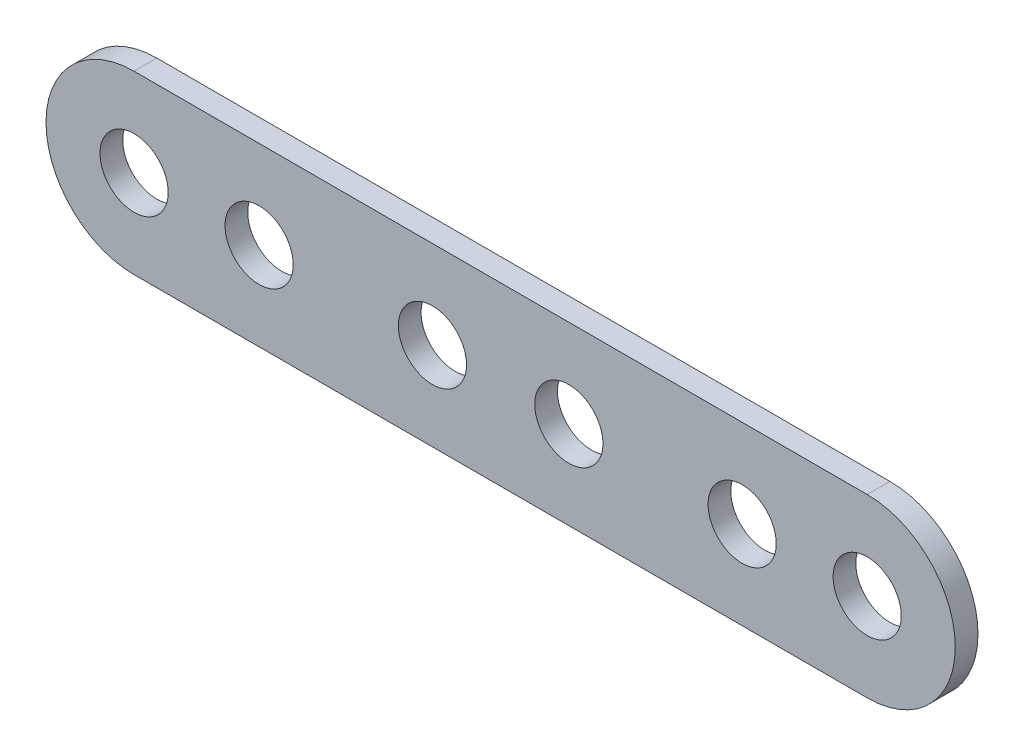
ISO-10303-21;
HEADER;
FILE_DESCRIPTION(('STEP AP214'),'2;1');
FILE_NAME('part.step','',(''),(''),'','','');
FILE_SCHEMA(('AUTOMOTIVE_DESIGN { 1 0 10303 214 1 1 1 1 }'));
ENDSEC;
DATA;
#1=APPLICATION_CONTEXT('core data for automotive mechanical design processes');
#2=APPLICATION_PROTOCOL_DEFINITION('international standard','automotive_design',2000,#1);
#3=PRODUCT_CONTEXT('',#1,'mechanical');
#4=PRODUCT('Part','Part','',(#3));
#5=PRODUCT_RELATED_PRODUCT_CATEGORY('part','',(#4));
#6=PRODUCT_DEFINITION_FORMATION('','',#4);
#7=PRODUCT_DEFINITION_CONTEXT('part definition',#1,'design');
#8=PRODUCT_DEFINITION('design','',#6,#7);
#9=PRODUCT_DEFINITION_SHAPE('','',#8);
#10=(LENGTH_UNIT() NAMED_UNIT(*) SI_UNIT(.MILLI.,.METRE.));
#11=(NAMED_UNIT(*) PLANE_ANGLE_UNIT() SI_UNIT($,.RADIAN.));
#12=(NAMED_UNIT(*) SI_UNIT($,.STERADIAN.) SOLID_ANGLE_UNIT());
#13=UNCERTAINTY_MEASURE_WITH_UNIT(LENGTH_MEASURE(1.E-05),#10,'distance_accuracy_value','');
#14=(GEOMETRIC_REPRESENTATION_CONTEXT(3) GLOBAL_UNCERTAINTY_ASSIGNED_CONTEXT((#13)) GLOBAL_UNIT_ASSIGNED_CONTEXT((#10,
#11,#12)) REPRESENTATION_CONTEXT('',''));
#15=CARTESIAN_POINT('',(0.,0.,0.));
#16=DIRECTION('',(0.,0.,1.));
#17=DIRECTION('',(1.,0.,0.));
#18=AXIS2_PLACEMENT_3D('',#15,#16,#17);
#19=CARTESIAN_POINT('',(-32.25,0.,2.));
#20=DIRECTION('',(0.,0.,1.));
#21=DIRECTION('',(1.,0.,0.));
#22=AXIS2_PLACEMENT_3D('',#19,#20,#21);
#23=PLANE('',#22);
#24=CARTESIAN_POINT('',(21.25,0.,2.));
#25=DIRECTION('',(0.,0.,1.));
#26=DIRECTION('',(-1.,0.,0.));
#27=AXIS2_PLACEMENT_3D('',#24,#25,#26);
#28=CIRCLE('',#27,3.);
#29=CARTESIAN_POINT('',(18.25,0.,2.));
#30=VERTEX_POINT('',#29);
#31=EDGE_CURVE('E137',#30,#30,#28,.T.);
#32=ORIENTED_EDGE('',*,*,#31,.F.);
#33=EDGE_LOOP('',(#32));
#34=FACE_BOUND('',#33,.T.);
#35=CARTESIAN_POINT('',(-32.25,0.,2.));
#36=DIRECTION('',(0.,0.,1.));
#37=DIRECTION('',(1.,0.,0.));
#38=AXIS2_PLACEMENT_3D('',#35,#36,#37);
#39=CIRCLE('',#38,2.99999999999999);
#40=CARTESIAN_POINT('',(-29.25,0.,2.));
#41=VERTEX_POINT('',#40);
#42=EDGE_CURVE('E125',#41,#41,#39,.T.);
#43=ORIENTED_EDGE('',*,*,#42,.F.);
#44=EDGE_LOOP('',(#43));
#45=FACE_BOUND('',#44,.T.);
#46=CARTESIAN_POINT('',(-21.25,0.,2.));
#47=DIRECTION('',(0.,0.,1.));
#48=DIRECTION('',(1.,0.,0.));
#49=AXIS2_PLACEMENT_3D('',#46,#47,#48);
#50=CIRCLE('',#49,3.);
#51=CARTESIAN_POINT('',(-18.25,0.,2.));
#52=VERTEX_POINT('',#51);
#53=EDGE_CURVE('E104',#52,#52,#50,.T.);
#54=ORIENTED_EDGE('',*,*,#53,.F.);
#55=EDGE_LOOP('',(#54));
#56=FACE_BOUND('',#55,.T.);
#57=CARTESIAN_POINT('',(-32.25,0.,2.));
#58=DIRECTION('',(0.,0.,1.));
#59=DIRECTION('',(1.,0.,0.));
#60=AXIS2_PLACEMENT_3D('',#57,#58,#59);
#61=CIRCLE('',#60,7.74999999999999);
#62=CARTESIAN_POINT('',(-32.25,7.75,2.));
#63=VERTEX_POINT('',#62);
#64=CARTESIAN_POINT('',(-32.25,-7.74999999999999,2.));
#65=VERTEX_POINT('',#64);
#66=EDGE_CURVE('E89',#63,#65,#61,.T.);
#67=ORIENTED_EDGE('',*,*,#66,.T.);
#68=DIRECTION('',(1.,0.,0.));
#69=VECTOR('',#68,1.);
#70=CARTESIAN_POINT('',(32.25,-7.74999999999999,2.));
#71=LINE('',#70,#69);
#72=CARTESIAN_POINT('',(32.25,-7.74999999999998,2.));
#73=VERTEX_POINT('',#72);
#74=EDGE_CURVE('E84',#65,#73,#71,.T.);
#75=ORIENTED_EDGE('',*,*,#74,.T.);
#76=CARTESIAN_POINT('',(32.25,0.,2.));
#77=DIRECTION('',(0.,0.,1.));
#78=DIRECTION('',(-1.,0.,0.));
#79=AXIS2_PLACEMENT_3D('',#76,#77,#78);
#80=CIRCLE('',#79,7.74999999999999);
#81=CARTESIAN_POINT('',(32.25,7.75,2.));
#82=VERTEX_POINT('',#81);
#83=EDGE_CURVE('E87',#73,#82,#80,.T.);
#84=ORIENTED_EDGE('',*,*,#83,.T.);
#85=DIRECTION('',(-1.,0.,0.));
#86=VECTOR('',#85,1.);
#87=CARTESIAN_POINT('',(32.25,7.75,2.));
#88=LINE('',#87,#86);
#89=EDGE_CURVE('E54',#82,#63,#88,.T.);
#90=ORIENTED_EDGE('',*,*,#89,.T.);
#91=EDGE_LOOP('',(#67,#75,#84,#90));
#92=FACE_BOUND('',#91,.T.);
#93=CARTESIAN_POINT('',(-6.00000000000001,0.,2.));
#94=DIRECTION('',(0.,0.,1.));
#95=DIRECTION('',(1.,0.,0.));
#96=AXIS2_PLACEMENT_3D('',#93,#94,#95);
#97=CIRCLE('',#96,3.00000000000001);
#98=CARTESIAN_POINT('',(-3.,0.,2.));
#99=VERTEX_POINT('',#98);
#100=EDGE_CURVE('E119',#99,#99,#97,.T.);
#101=ORIENTED_EDGE('',*,*,#100,.F.);
#102=EDGE_LOOP('',(#101));
#103=FACE_BOUND('',#102,.T.);
#104=CARTESIAN_POINT('',(6.00000000000001,0.,2.));
#105=DIRECTION('',(0.,0.,1.));
#106=DIRECTION('',(-1.,0.,0.));
#107=AXIS2_PLACEMENT_3D('',#104,#105,#106);
#108=CIRCLE('',#107,3.00000000000001);
#109=CARTESIAN_POINT('',(3.,0.,2.));
#110=VERTEX_POINT('',#109);
#111=EDGE_CURVE('E131',#110,#110,#108,.T.);
#112=ORIENTED_EDGE('',*,*,#111,.F.);
#113=EDGE_LOOP('',(#112));
#114=FACE_BOUND('',#113,.T.);
#115=CARTESIAN_POINT('',(32.25,0.,2.));
#116=DIRECTION('',(0.,0.,1.));
#117=DIRECTION('',(-1.,0.,0.));
#118=AXIS2_PLACEMENT_3D('',#115,#116,#117);
#119=CIRCLE('',#118,2.99999999999999);
#120=CARTESIAN_POINT('',(29.25,0.,2.));
#121=VERTEX_POINT('',#120);
#122=EDGE_CURVE('E143',#121,#121,#119,.T.);
#123=ORIENTED_EDGE('',*,*,#122,.F.);
#124=EDGE_LOOP('',(#123));
#125=FACE_BOUND('',#124,.T.);
#126=ADVANCED_FACE('F37',(#34,#45,#56,#92,#103,#114,#125),#23,.T.);
#127=CARTESIAN_POINT('',(-32.25,0.,0.));
#128=DIRECTION('',(0.,0.,1.));
#129=DIRECTION('',(1.,0.,0.));
#130=AXIS2_PLACEMENT_3D('',#127,#128,#129);
#131=PLANE('',#130);
#132=CARTESIAN_POINT('',(-32.25,0.,0.));
#133=DIRECTION('',(0.,0.,1.));
#134=DIRECTION('',(1.,0.,0.));
#135=AXIS2_PLACEMENT_3D('',#132,#133,#134);
#136=CIRCLE('',#135,7.74999999999999);
#137=CARTESIAN_POINT('',(-32.25,7.75,0.));
#138=VERTEX_POINT('',#137);
#139=CARTESIAN_POINT('',(-32.25,-7.74999999999999,0.));
#140=VERTEX_POINT('',#139);
#141=EDGE_CURVE('E101',#138,#140,#136,.T.);
#142=ORIENTED_EDGE('',*,*,#141,.F.);
#143=DIRECTION('',(-1.,0.,0.));
#144=VECTOR('',#143,1.);
#145=CARTESIAN_POINT('',(32.25,7.75,0.));
#146=LINE('',#145,#144);
#147=CARTESIAN_POINT('',(32.25,7.75,0.));
#148=VERTEX_POINT('',#147);
#149=EDGE_CURVE('E77',#148,#138,#146,.T.);
#150=ORIENTED_EDGE('',*,*,#149,.F.);
#151=CARTESIAN_POINT('',(32.25,0.,0.));
#152=DIRECTION('',(0.,0.,1.));
#153=DIRECTION('',(-1.,0.,0.));
#154=AXIS2_PLACEMENT_3D('',#151,#152,#153);
#155=CIRCLE('',#154,7.74999999999999);
#156=CARTESIAN_POINT('',(32.25,-7.74999999999998,0.));
#157=VERTEX_POINT('',#156);
#158=EDGE_CURVE('E71',#157,#148,#155,.T.);
#159=ORIENTED_EDGE('',*,*,#158,.F.);
#160=DIRECTION('',(1.,0.,0.));
#161=VECTOR('',#160,1.);
#162=CARTESIAN_POINT('',(32.25,-7.74999999999999,0.));
#163=LINE('',#162,#161);
#164=EDGE_CURVE('E93',#140,#157,#163,.T.);
#165=ORIENTED_EDGE('',*,*,#164,.F.);
#166=EDGE_LOOP('',(#142,#150,#159,#165));
#167=FACE_BOUND('',#166,.T.);
#168=CARTESIAN_POINT('',(-21.25,0.,0.));
#169=DIRECTION('',(0.,0.,1.));
#170=DIRECTION('',(1.,0.,0.));
#171=AXIS2_PLACEMENT_3D('',#168,#169,#170);
#172=CIRCLE('',#171,3.);
#173=CARTESIAN_POINT('',(-18.25,0.,0.));
#174=VERTEX_POINT('',#173);
#175=EDGE_CURVE('E116',#174,#174,#172,.T.);
#176=ORIENTED_EDGE('',*,*,#175,.T.);
#177=EDGE_LOOP('',(#176));
#178=FACE_BOUND('',#177,.T.);
#179=CARTESIAN_POINT('',(-6.00000000000001,0.,0.));
#180=DIRECTION('',(0.,0.,1.));
#181=DIRECTION('',(1.,0.,0.));
#182=AXIS2_PLACEMENT_3D('',#179,#180,#181);
#183=CIRCLE('',#182,3.00000000000001);
#184=CARTESIAN_POINT('',(-3.,0.,0.));
#185=VERTEX_POINT('',#184);
#186=EDGE_CURVE('E122',#185,#185,#183,.T.);
#187=ORIENTED_EDGE('',*,*,#186,.T.);
#188=EDGE_LOOP('',(#187));
#189=FACE_BOUND('',#188,.T.);
#190=CARTESIAN_POINT('',(-32.25,0.,0.));
#191=DIRECTION('',(0.,0.,1.));
#192=DIRECTION('',(1.,0.,0.));
#193=AXIS2_PLACEMENT_3D('',#190,#191,#192);
#194=CIRCLE('',#193,2.99999999999999);
#195=CARTESIAN_POINT('',(-29.25,0.,0.));
#196=VERTEX_POINT('',#195);
#197=EDGE_CURVE('E128',#196,#196,#194,.T.);
#198=ORIENTED_EDGE('',*,*,#197,.T.);
#199=EDGE_LOOP('',(#198));
#200=FACE_BOUND('',#199,.T.);
#201=CARTESIAN_POINT('',(6.00000000000001,0.,0.));
#202=DIRECTION('',(0.,0.,1.));
#203=DIRECTION('',(-1.,0.,0.));
#204=AXIS2_PLACEMENT_3D('',#201,#202,#203);
#205=CIRCLE('',#204,3.00000000000001);
#206=CARTESIAN_POINT('',(3.,0.,0.));
#207=VERTEX_POINT('',#206);
#208=EDGE_CURVE('E134',#207,#207,#205,.T.);
#209=ORIENTED_EDGE('',*,*,#208,.T.);
#210=EDGE_LOOP('',(#209));
#211=FACE_BOUND('',#210,.T.);
#212=CARTESIAN_POINT('',(21.25,0.,0.));
#213=DIRECTION('',(0.,0.,1.));
#214=DIRECTION('',(-1.,0.,0.));
#215=AXIS2_PLACEMENT_3D('',#212,#213,#214);
#216=CIRCLE('',#215,3.);
#217=CARTESIAN_POINT('',(18.25,0.,0.));
#218=VERTEX_POINT('',#217);
#219=EDGE_CURVE('E140',#218,#218,#216,.T.);
#220=ORIENTED_EDGE('',*,*,#219,.T.);
#221=EDGE_LOOP('',(#220));
#222=FACE_BOUND('',#221,.T.);
#223=CARTESIAN_POINT('',(32.25,0.,0.));
#224=DIRECTION('',(0.,0.,1.));
#225=DIRECTION('',(-1.,0.,0.));
#226=AXIS2_PLACEMENT_3D('',#223,#224,#225);
#227=CIRCLE('',#226,2.99999999999999);
#228=CARTESIAN_POINT('',(29.25,0.,0.));
#229=VERTEX_POINT('',#228);
#230=EDGE_CURVE('E146',#229,#229,#227,.T.);
#231=ORIENTED_EDGE('',*,*,#230,.T.);
#232=EDGE_LOOP('',(#231));
#233=FACE_BOUND('',#232,.T.);
#234=ADVANCED_FACE('F112',(#167,#178,#189,#200,#211,#222,#233),#131,.F.);
#235=CARTESIAN_POINT('',(-32.25,0.,2.));
#236=DIRECTION('',(0.,0.,-1.));
#237=DIRECTION('',(-1.,0.,0.));
#238=AXIS2_PLACEMENT_3D('',#235,#236,#237);
#239=CYLINDRICAL_SURFACE('',#238,7.74999999999999);
#240=ORIENTED_EDGE('',*,*,#141,.T.);
#241=DIRECTION('',(0.,0.,-1.));
#242=VECTOR('',#241,1.);
#243=CARTESIAN_POINT('',(-32.25,-7.74999999999999,2.));
#244=LINE('',#243,#242);
#245=EDGE_CURVE('E11',#65,#140,#244,.T.);
#246=ORIENTED_EDGE('',*,*,#245,.F.);
#247=ORIENTED_EDGE('',*,*,#66,.F.);
#248=DIRECTION('',(0.,0.,-1.));
#249=VECTOR('',#248,1.);
#250=CARTESIAN_POINT('',(-32.25,7.75,2.));
#251=LINE('',#250,#249);
#252=EDGE_CURVE('E97',#63,#138,#251,.T.);
#253=ORIENTED_EDGE('',*,*,#252,.T.);
#254=EDGE_LOOP('',(#240,#246,#247,#253));
#255=FACE_BOUND('',#254,.T.);
#256=ADVANCED_FACE('F39',(#255),#239,.T.);
#257=CARTESIAN_POINT('',(32.25,-7.74999999999999,2.));
#258=DIRECTION('',(0.,1.,0.));
#259=DIRECTION('',(0.,0.,1.));
#260=AXIS2_PLACEMENT_3D('',#257,#258,#259);
#261=PLANE('',#260);
#262=ORIENTED_EDGE('',*,*,#164,.T.);
#263=DIRECTION('',(0.,0.,-1.));
#264=VECTOR('',#263,1.);
#265=CARTESIAN_POINT('',(32.25,-7.74999999999998,2.));
#266=LINE('',#265,#264);
#267=EDGE_CURVE('E46',#73,#157,#266,.T.);
#268=ORIENTED_EDGE('',*,*,#267,.F.);
#269=ORIENTED_EDGE('',*,*,#74,.F.);
#270=ORIENTED_EDGE('',*,*,#245,.T.);
#271=EDGE_LOOP('',(#262,#268,#269,#270));
#272=FACE_BOUND('',#271,.T.);
#273=ADVANCED_FACE('F92',(#272),#261,.F.);
#274=CARTESIAN_POINT('',(32.25,0.,2.));
#275=DIRECTION('',(0.,0.,-1.));
#276=DIRECTION('',(-1.,0.,0.));
#277=AXIS2_PLACEMENT_3D('',#274,#275,#276);
#278=CYLINDRICAL_SURFACE('',#277,7.74999999999999);
#279=ORIENTED_EDGE('',*,*,#158,.T.);
#280=DIRECTION('',(0.,0.,-1.));
#281=VECTOR('',#280,1.);
#282=CARTESIAN_POINT('',(32.25,7.75,2.));
#283=LINE('',#282,#281);
#284=EDGE_CURVE('E94',#82,#148,#283,.T.);
#285=ORIENTED_EDGE('',*,*,#284,.F.);
#286=ORIENTED_EDGE('',*,*,#83,.F.);
#287=ORIENTED_EDGE('',*,*,#267,.T.);
#288=EDGE_LOOP('',(#279,#285,#286,#287));
#289=FACE_BOUND('',#288,.T.);
#290=ADVANCED_FACE('F95',(#289),#278,.T.);
#291=CARTESIAN_POINT('',(32.25,7.75,2.));
#292=DIRECTION('',(0.,-1.,0.));
#293=DIRECTION('',(0.,0.,-1.));
#294=AXIS2_PLACEMENT_3D('',#291,#292,#293);
#295=PLANE('',#294);
#296=ORIENTED_EDGE('',*,*,#149,.T.);
#297=ORIENTED_EDGE('',*,*,#252,.F.);
#298=ORIENTED_EDGE('',*,*,#89,.F.);
#299=ORIENTED_EDGE('',*,*,#284,.T.);
#300=EDGE_LOOP('',(#296,#297,#298,#299));
#301=FACE_BOUND('',#300,.T.);
#302=ADVANCED_FACE('F109',(#301),#295,.F.);
#303=CARTESIAN_POINT('',(-21.25,0.,2.));
#304=DIRECTION('',(0.,0.,-1.));
#305=DIRECTION('',(-1.,0.,0.));
#306=AXIS2_PLACEMENT_3D('',#303,#304,#305);
#307=CYLINDRICAL_SURFACE('',#306,3.);
#308=ORIENTED_EDGE('',*,*,#53,.T.);
#309=EDGE_LOOP('',(#308));
#310=FACE_BOUND('',#309,.T.);
#311=ORIENTED_EDGE('',*,*,#175,.F.);
#312=EDGE_LOOP('',(#311));
#313=FACE_BOUND('',#312,.T.);
#314=ADVANCED_FACE('F165',(#310,#313),#307,.F.);
#315=CARTESIAN_POINT('',(-6.00000000000001,0.,2.));
#316=DIRECTION('',(0.,0.,-1.));
#317=DIRECTION('',(-1.,0.,0.));
#318=AXIS2_PLACEMENT_3D('',#315,#316,#317);
#319=CYLINDRICAL_SURFACE('',#318,3.00000000000001);
#320=ORIENTED_EDGE('',*,*,#100,.T.);
#321=EDGE_LOOP('',(#320));
#322=FACE_BOUND('',#321,.T.);
#323=ORIENTED_EDGE('',*,*,#186,.F.);
#324=EDGE_LOOP('',(#323));
#325=FACE_BOUND('',#324,.T.);
#326=ADVANCED_FACE('F211',(#322,#325),#319,.F.);
#327=CARTESIAN_POINT('',(-32.25,0.,2.));
#328=DIRECTION('',(0.,0.,-1.));
#329=DIRECTION('',(-1.,0.,0.));
#330=AXIS2_PLACEMENT_3D('',#327,#328,#329);
#331=CYLINDRICAL_SURFACE('',#330,2.99999999999999);
#332=ORIENTED_EDGE('',*,*,#42,.T.);
#333=EDGE_LOOP('',(#332));
#334=FACE_BOUND('',#333,.T.);
#335=ORIENTED_EDGE('',*,*,#197,.F.);
#336=EDGE_LOOP('',(#335));
#337=FACE_BOUND('',#336,.T.);
#338=ADVANCED_FACE('F219',(#334,#337),#331,.F.);
#339=CARTESIAN_POINT('',(6.00000000000001,0.,2.));
#340=DIRECTION('',(0.,0.,-1.));
#341=DIRECTION('',(-1.,0.,0.));
#342=AXIS2_PLACEMENT_3D('',#339,#340,#341);
#343=CYLINDRICAL_SURFACE('',#342,3.00000000000001);
#344=ORIENTED_EDGE('',*,*,#111,.T.);
#345=EDGE_LOOP('',(#344));
#346=FACE_BOUND('',#345,.T.);
#347=ORIENTED_EDGE('',*,*,#208,.F.);
#348=EDGE_LOOP('',(#347));
#349=FACE_BOUND('',#348,.T.);
#350=ADVANCED_FACE('F227',(#346,#349),#343,.F.);
#351=CARTESIAN_POINT('',(21.25,0.,2.));
#352=DIRECTION('',(0.,0.,-1.));
#353=DIRECTION('',(-1.,0.,0.));
#354=AXIS2_PLACEMENT_3D('',#351,#352,#353);
#355=CYLINDRICAL_SURFACE('',#354,3.);
#356=ORIENTED_EDGE('',*,*,#31,.T.);
#357=EDGE_LOOP('',(#356));
#358=FACE_BOUND('',#357,.T.);
#359=ORIENTED_EDGE('',*,*,#219,.F.);
#360=EDGE_LOOP('',(#359));
#361=FACE_BOUND('',#360,.T.);
#362=ADVANCED_FACE('F236',(#358,#361),#355,.F.);
#363=CARTESIAN_POINT('',(32.25,0.,2.));
#364=DIRECTION('',(0.,0.,-1.));
#365=DIRECTION('',(-1.,0.,0.));
#366=AXIS2_PLACEMENT_3D('',#363,#364,#365);
#367=CYLINDRICAL_SURFACE('',#366,2.99999999999999);
#368=ORIENTED_EDGE('',*,*,#122,.T.);
#369=EDGE_LOOP('',(#368));
#370=FACE_BOUND('',#369,.T.);
#371=ORIENTED_EDGE('',*,*,#230,.F.);
#372=EDGE_LOOP('',(#371));
#373=FACE_BOUND('',#372,.T.);
#374=ADVANCED_FACE('F152',(#370,#373),#367,.F.);
#375=CLOSED_SHELL('',(#126,#234,#256,#273,#290,#302,#314,#326,#338,#350,#362,#374));
#376=MANIFOLD_SOLID_BREP('B2',#375);
#377=ADVANCED_BREP_SHAPE_REPRESENTATION('',(#18,#376),#14);
#378=SHAPE_DEFINITION_REPRESENTATION(#9,#377);
ENDSEC;
END-ISO-10303-21;
